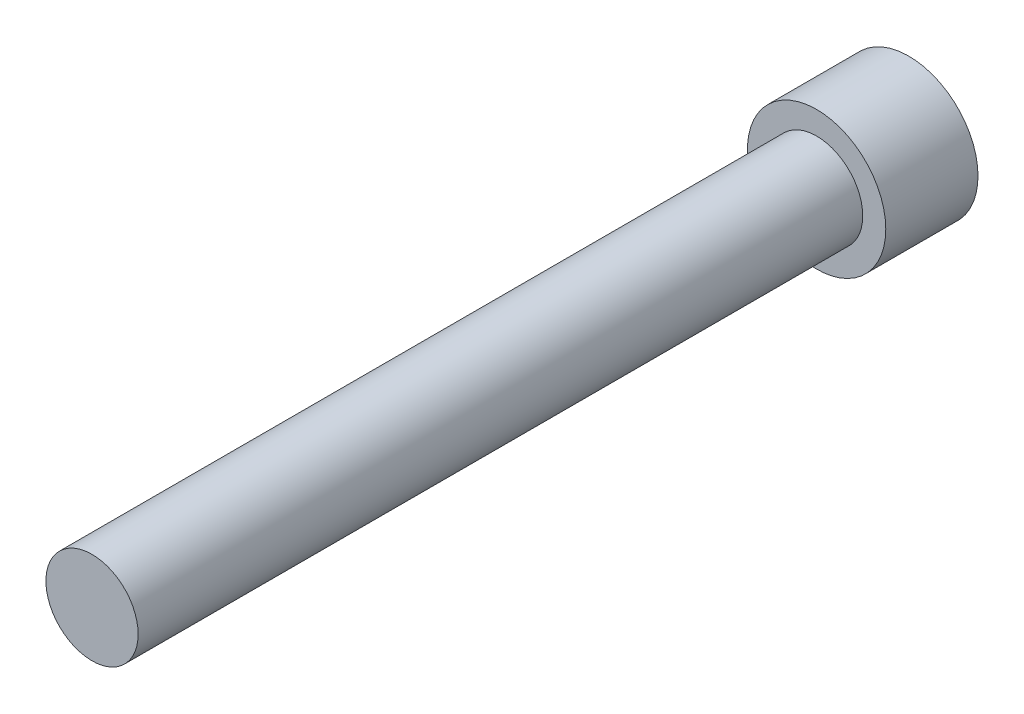
ISO-10303-21;
HEADER;
FILE_DESCRIPTION(('STEP AP214'),'2;1');
FILE_NAME('part.step','',(''),(''),'','','');
FILE_SCHEMA(('AUTOMOTIVE_DESIGN { 1 0 10303 214 1 1 1 1 }'));
ENDSEC;
DATA;
#1=APPLICATION_CONTEXT('core data for automotive mechanical design processes');
#2=APPLICATION_PROTOCOL_DEFINITION('international standard','automotive_design',2000,#1);
#3=PRODUCT_CONTEXT('',#1,'mechanical');
#4=PRODUCT('Part','Part','',(#3));
#5=PRODUCT_RELATED_PRODUCT_CATEGORY('part','',(#4));
#6=PRODUCT_DEFINITION_FORMATION('','',#4);
#7=PRODUCT_DEFINITION_CONTEXT('part definition',#1,'design');
#8=PRODUCT_DEFINITION('design','',#6,#7);
#9=PRODUCT_DEFINITION_SHAPE('','',#8);
#10=(LENGTH_UNIT() NAMED_UNIT(*) SI_UNIT(.MILLI.,.METRE.));
#11=(NAMED_UNIT(*) PLANE_ANGLE_UNIT() SI_UNIT($,.RADIAN.));
#12=(NAMED_UNIT(*) SI_UNIT($,.STERADIAN.) SOLID_ANGLE_UNIT());
#13=UNCERTAINTY_MEASURE_WITH_UNIT(LENGTH_MEASURE(1.E-05),#10,'distance_accuracy_value','');
#14=(GEOMETRIC_REPRESENTATION_CONTEXT(3) GLOBAL_UNCERTAINTY_ASSIGNED_CONTEXT((#13)) GLOBAL_UNIT_ASSIGNED_CONTEXT((#10,
#11,#12)) REPRESENTATION_CONTEXT('',''));
#15=CARTESIAN_POINT('',(0.,0.,0.));
#16=DIRECTION('',(0.,0.,1.));
#17=DIRECTION('',(1.,0.,0.));
#18=AXIS2_PLACEMENT_3D('',#15,#16,#17);
#19=CARTESIAN_POINT('',(-16.4104837985818,16.5449959608653,14.));
#20=DIRECTION('',(0.,0.,-1.));
#21=DIRECTION('',(-1.,0.,0.));
#22=AXIS2_PLACEMENT_3D('',#19,#20,#21);
#23=CYLINDRICAL_SURFACE('',#22,10.5);
#24=CARTESIAN_POINT('',(-16.4104837985818,16.5449959608653,14.));
#25=DIRECTION('',(0.,0.,1.));
#26=DIRECTION('',(1.,0.,0.));
#27=AXIS2_PLACEMENT_3D('',#24,#25,#26);
#28=CIRCLE('',#27,10.5);
#29=CARTESIAN_POINT('',(-5.91048379858179,16.5449959608653,14.));
#30=VERTEX_POINT('',#29);
#31=EDGE_CURVE('E43',#30,#30,#28,.T.);
#32=ORIENTED_EDGE('',*,*,#31,.F.);
#33=EDGE_LOOP('',(#32));
#34=FACE_BOUND('',#33,.T.);
#35=CARTESIAN_POINT('',(-16.4104837985818,16.5449959608653,0.));
#36=DIRECTION('',(0.,0.,1.));
#37=DIRECTION('',(1.,0.,0.));
#38=AXIS2_PLACEMENT_3D('',#35,#36,#37);
#39=CIRCLE('',#38,10.5);
#40=CARTESIAN_POINT('',(-5.91048379858179,16.5449959608653,0.));
#41=VERTEX_POINT('',#40);
#42=EDGE_CURVE('E39',#41,#41,#39,.T.);
#43=ORIENTED_EDGE('',*,*,#42,.T.);
#44=EDGE_LOOP('',(#43));
#45=FACE_BOUND('',#44,.T.);
#46=ADVANCED_FACE('F36',(#34,#45),#23,.T.);
#47=CARTESIAN_POINT('',(-16.4104837985818,16.5449959608653,14.));
#48=DIRECTION('',(0.,0.,1.));
#49=DIRECTION('',(1.,0.,0.));
#50=AXIS2_PLACEMENT_3D('',#47,#48,#49);
#51=PLANE('',#50);
#52=CARTESIAN_POINT('',(-16.4104837985818,16.5449959608653,14.));
#53=DIRECTION('',(0.,0.,1.));
#54=DIRECTION('',(1.,0.,0.));
#55=AXIS2_PLACEMENT_3D('',#52,#53,#54);
#56=CIRCLE('',#55,7.);
#57=CARTESIAN_POINT('',(-9.41048379858179,16.5449959608653,14.));
#58=VERTEX_POINT('',#57);
#59=EDGE_CURVE('E10',#58,#58,#56,.T.);
#60=ORIENTED_EDGE('',*,*,#59,.F.);
#61=EDGE_LOOP('',(#60));
#62=FACE_BOUND('',#61,.T.);
#63=ORIENTED_EDGE('',*,*,#31,.T.);
#64=EDGE_LOOP('',(#63));
#65=FACE_BOUND('',#64,.T.);
#66=ADVANCED_FACE('F60',(#62,#65),#51,.T.);
#67=CARTESIAN_POINT('',(-16.4104837985818,16.5449959608653,0.));
#68=DIRECTION('',(0.,0.,1.));
#69=DIRECTION('',(1.,0.,0.));
#70=AXIS2_PLACEMENT_3D('',#67,#68,#69);
#71=PLANE('',#70);
#72=ORIENTED_EDGE('',*,*,#42,.F.);
#73=EDGE_LOOP('',(#72));
#74=FACE_BOUND('',#73,.T.);
#75=ADVANCED_FACE('F57',(#74),#71,.F.);
#76=CARTESIAN_POINT('',(-16.4104837985818,16.5449959608653,124.));
#77=DIRECTION('',(0.,0.,-1.));
#78=DIRECTION('',(-1.,0.,0.));
#79=AXIS2_PLACEMENT_3D('',#76,#77,#78);
#80=CYLINDRICAL_SURFACE('',#79,7.);
#81=CARTESIAN_POINT('',(-16.4104837985818,16.5449959608653,124.));
#82=DIRECTION('',(0.,0.,1.));
#83=DIRECTION('',(1.,0.,0.));
#84=AXIS2_PLACEMENT_3D('',#81,#82,#83);
#85=CIRCLE('',#84,7.);
#86=CARTESIAN_POINT('',(-9.41048379858179,16.5449959608653,124.));
#87=VERTEX_POINT('',#86);
#88=EDGE_CURVE('E49',#87,#87,#85,.T.);
#89=ORIENTED_EDGE('',*,*,#88,.F.);
#90=EDGE_LOOP('',(#89));
#91=FACE_BOUND('',#90,.T.);
#92=ORIENTED_EDGE('',*,*,#59,.T.);
#93=EDGE_LOOP('',(#92));
#94=FACE_BOUND('',#93,.T.);
#95=ADVANCED_FACE('F59',(#91,#94),#80,.T.);
#96=CARTESIAN_POINT('',(-16.4104837985818,16.5449959608653,124.));
#97=DIRECTION('',(0.,0.,1.));
#98=DIRECTION('',(1.,0.,0.));
#99=AXIS2_PLACEMENT_3D('',#96,#97,#98);
#100=PLANE('',#99);
#101=ORIENTED_EDGE('',*,*,#88,.T.);
#102=EDGE_LOOP('',(#101));
#103=FACE_BOUND('',#102,.T.);
#104=ADVANCED_FACE('F65',(#103),#100,.T.);
#105=CLOSED_SHELL('',(#46,#66,#75,#95,#104));
#106=MANIFOLD_SOLID_BREP('B2',#105);
#107=ADVANCED_BREP_SHAPE_REPRESENTATION('',(#18,#106),#14);
#108=SHAPE_DEFINITION_REPRESENTATION(#9,#107);
ENDSEC;
END-ISO-10303-21;
